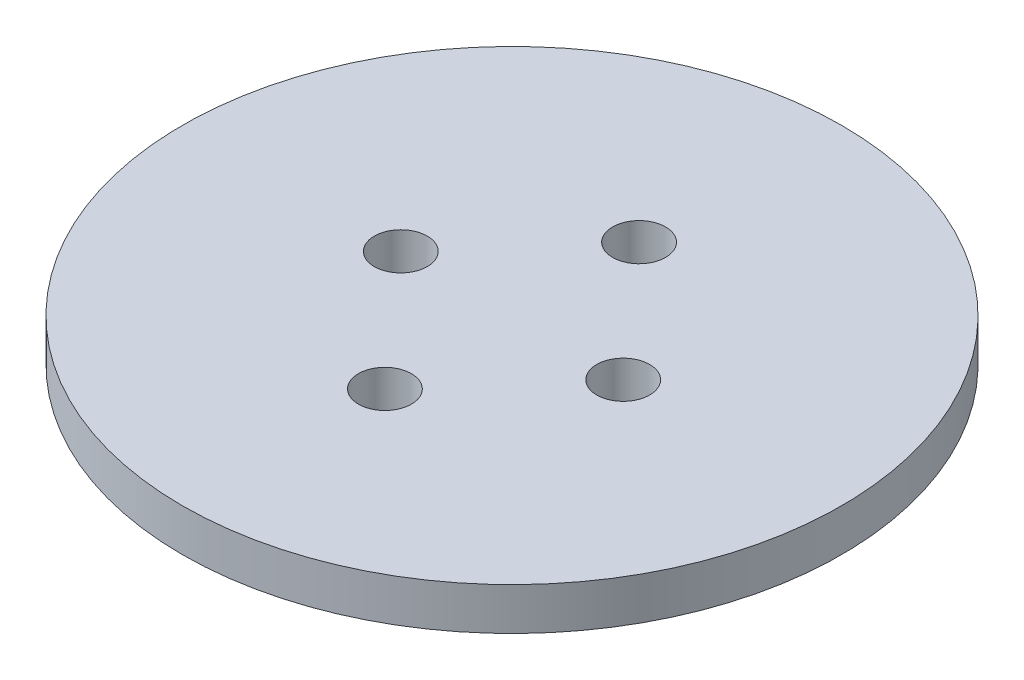
ISO-10303-21;
HEADER;
FILE_DESCRIPTION(('STEP AP214'),'2;1');
FILE_NAME('part.step','',(''),(''),'','','');
FILE_SCHEMA(('AUTOMOTIVE_DESIGN { 1 0 10303 214 1 1 1 1 }'));
ENDSEC;
DATA;
#1=APPLICATION_CONTEXT('core data for automotive mechanical design processes');
#2=APPLICATION_PROTOCOL_DEFINITION('international standard','automotive_design',2000,#1);
#3=PRODUCT_CONTEXT('',#1,'mechanical');
#4=PRODUCT('Part','Part','',(#3));
#5=PRODUCT_RELATED_PRODUCT_CATEGORY('part','',(#4));
#6=PRODUCT_DEFINITION_FORMATION('','',#4);
#7=PRODUCT_DEFINITION_CONTEXT('part definition',#1,'design');
#8=PRODUCT_DEFINITION('design','',#6,#7);
#9=PRODUCT_DEFINITION_SHAPE('','',#8);
#10=(LENGTH_UNIT() NAMED_UNIT(*) SI_UNIT(.MILLI.,.METRE.));
#11=(NAMED_UNIT(*) PLANE_ANGLE_UNIT() SI_UNIT($,.RADIAN.));
#12=(NAMED_UNIT(*) SI_UNIT($,.STERADIAN.) SOLID_ANGLE_UNIT());
#13=UNCERTAINTY_MEASURE_WITH_UNIT(LENGTH_MEASURE(1.E-05),#10,'distance_accuracy_value','');
#14=(GEOMETRIC_REPRESENTATION_CONTEXT(3) GLOBAL_UNCERTAINTY_ASSIGNED_CONTEXT((#13)) GLOBAL_UNIT_ASSIGNED_CONTEXT((#10,
#11,#12)) REPRESENTATION_CONTEXT('',''));
#15=CARTESIAN_POINT('',(0.,0.,0.));
#16=DIRECTION('',(0.,0.,1.));
#17=DIRECTION('',(1.,0.,0.));
#18=AXIS2_PLACEMENT_3D('',#15,#16,#17);
#19=CARTESIAN_POINT('',(0.,6.35,0.));
#20=DIRECTION('',(0.,-1.,0.));
#21=DIRECTION('',(0.,0.,-1.));
#22=AXIS2_PLACEMENT_3D('',#19,#20,#21);
#23=CYLINDRICAL_SURFACE('',#22,49.403);
#24=CARTESIAN_POINT('',(0.,6.35,0.));
#25=DIRECTION('',(0.,1.,0.));
#26=DIRECTION('',(0.,0.,1.));
#27=AXIS2_PLACEMENT_3D('',#24,#25,#26);
#28=CIRCLE('',#27,49.403);
#29=CARTESIAN_POINT('',(0.,6.35,49.403));
#30=VERTEX_POINT('',#29);
#31=EDGE_CURVE('E10',#30,#30,#28,.T.);
#32=ORIENTED_EDGE('',*,*,#31,.F.);
#33=EDGE_LOOP('',(#32));
#34=FACE_BOUND('',#33,.T.);
#35=CARTESIAN_POINT('',(0.,0.,0.));
#36=DIRECTION('',(0.,1.,0.));
#37=DIRECTION('',(0.,0.,1.));
#38=AXIS2_PLACEMENT_3D('',#35,#36,#37);
#39=CIRCLE('',#38,49.403);
#40=CARTESIAN_POINT('',(0.,0.,49.403));
#41=VERTEX_POINT('',#40);
#42=EDGE_CURVE('E42',#41,#41,#39,.T.);
#43=ORIENTED_EDGE('',*,*,#42,.T.);
#44=EDGE_LOOP('',(#43));
#45=FACE_BOUND('',#44,.T.);
#46=ADVANCED_FACE('F39',(#34,#45),#23,.T.);
#47=CARTESIAN_POINT('',(0.,6.35,0.));
#48=DIRECTION('',(0.,1.,0.));
#49=DIRECTION('',(0.,0.,1.));
#50=AXIS2_PLACEMENT_3D('',#47,#48,#49);
#51=PLANE('',#50);
#52=CARTESIAN_POINT('',(-16.66875,6.35,0.));
#53=DIRECTION('',(0.,1.,0.));
#54=DIRECTION('',(0.,0.,1.));
#55=AXIS2_PLACEMENT_3D('',#52,#53,#54);
#56=CIRCLE('',#55,3.96875);
#57=CARTESIAN_POINT('',(-16.66875,6.35,3.96875));
#58=VERTEX_POINT('',#57);
#59=EDGE_CURVE('E71',#58,#58,#56,.T.);
#60=ORIENTED_EDGE('',*,*,#59,.F.);
#61=EDGE_LOOP('',(#60));
#62=FACE_BOUND('',#61,.T.);
#63=CARTESIAN_POINT('',(16.66875,6.35,0.));
#64=DIRECTION('',(0.,1.,0.));
#65=DIRECTION('',(0.,0.,1.));
#66=AXIS2_PLACEMENT_3D('',#63,#64,#65);
#67=CIRCLE('',#66,3.96875);
#68=CARTESIAN_POINT('',(16.66875,6.35,3.96875));
#69=VERTEX_POINT('',#68);
#70=EDGE_CURVE('E65',#69,#69,#67,.T.);
#71=ORIENTED_EDGE('',*,*,#70,.F.);
#72=EDGE_LOOP('',(#71));
#73=FACE_BOUND('',#72,.T.);
#74=CARTESIAN_POINT('',(0.,6.35,-19.05));
#75=DIRECTION('',(0.,1.,0.));
#76=DIRECTION('',(0.,0.,1.));
#77=AXIS2_PLACEMENT_3D('',#74,#75,#76);
#78=CIRCLE('',#77,3.96875);
#79=CARTESIAN_POINT('',(0.,6.35,-15.08125));
#80=VERTEX_POINT('',#79);
#81=EDGE_CURVE('E59',#80,#80,#78,.T.);
#82=ORIENTED_EDGE('',*,*,#81,.F.);
#83=EDGE_LOOP('',(#82));
#84=FACE_BOUND('',#83,.T.);
#85=CARTESIAN_POINT('',(0.,6.35,19.05));
#86=DIRECTION('',(0.,1.,0.));
#87=DIRECTION('',(0.,0.,1.));
#88=AXIS2_PLACEMENT_3D('',#85,#86,#87);
#89=CIRCLE('',#88,3.96875);
#90=CARTESIAN_POINT('',(0.,6.35,23.01875));
#91=VERTEX_POINT('',#90);
#92=EDGE_CURVE('E53',#91,#91,#89,.T.);
#93=ORIENTED_EDGE('',*,*,#92,.F.);
#94=EDGE_LOOP('',(#93));
#95=FACE_BOUND('',#94,.T.);
#96=ORIENTED_EDGE('',*,*,#31,.T.);
#97=EDGE_LOOP('',(#96));
#98=FACE_BOUND('',#97,.T.);
#99=ADVANCED_FACE('F77',(#62,#73,#84,#95,#98),#51,.T.);
#100=CARTESIAN_POINT('',(0.,0.,0.));
#101=DIRECTION('',(0.,1.,0.));
#102=DIRECTION('',(0.,0.,1.));
#103=AXIS2_PLACEMENT_3D('',#100,#101,#102);
#104=PLANE('',#103);
#105=CARTESIAN_POINT('',(-16.66875,0.,0.));
#106=DIRECTION('',(0.,1.,0.));
#107=DIRECTION('',(0.,0.,1.));
#108=AXIS2_PLACEMENT_3D('',#105,#106,#107);
#109=CIRCLE('',#108,3.96875);
#110=CARTESIAN_POINT('',(-16.66875,0.,3.96875));
#111=VERTEX_POINT('',#110);
#112=EDGE_CURVE('E68',#111,#111,#109,.T.);
#113=ORIENTED_EDGE('',*,*,#112,.T.);
#114=EDGE_LOOP('',(#113));
#115=FACE_BOUND('',#114,.T.);
#116=CARTESIAN_POINT('',(16.66875,0.,0.));
#117=DIRECTION('',(0.,1.,0.));
#118=DIRECTION('',(0.,0.,1.));
#119=AXIS2_PLACEMENT_3D('',#116,#117,#118);
#120=CIRCLE('',#119,3.96875);
#121=CARTESIAN_POINT('',(16.66875,0.,3.96875));
#122=VERTEX_POINT('',#121);
#123=EDGE_CURVE('E62',#122,#122,#120,.T.);
#124=ORIENTED_EDGE('',*,*,#123,.T.);
#125=EDGE_LOOP('',(#124));
#126=FACE_BOUND('',#125,.T.);
#127=CARTESIAN_POINT('',(0.,0.,-19.05));
#128=DIRECTION('',(0.,1.,0.));
#129=DIRECTION('',(0.,0.,1.));
#130=AXIS2_PLACEMENT_3D('',#127,#128,#129);
#131=CIRCLE('',#130,3.96875);
#132=CARTESIAN_POINT('',(0.,0.,-15.08125));
#133=VERTEX_POINT('',#132);
#134=EDGE_CURVE('E56',#133,#133,#131,.T.);
#135=ORIENTED_EDGE('',*,*,#134,.T.);
#136=EDGE_LOOP('',(#135));
#137=FACE_BOUND('',#136,.T.);
#138=CARTESIAN_POINT('',(0.,0.,19.05));
#139=DIRECTION('',(0.,1.,0.));
#140=DIRECTION('',(0.,0.,1.));
#141=AXIS2_PLACEMENT_3D('',#138,#139,#140);
#142=CIRCLE('',#141,3.96875);
#143=CARTESIAN_POINT('',(0.,0.,23.01875));
#144=VERTEX_POINT('',#143);
#145=EDGE_CURVE('E49',#144,#144,#142,.T.);
#146=ORIENTED_EDGE('',*,*,#145,.T.);
#147=EDGE_LOOP('',(#146));
#148=FACE_BOUND('',#147,.T.);
#149=ORIENTED_EDGE('',*,*,#42,.F.);
#150=EDGE_LOOP('',(#149));
#151=FACE_BOUND('',#150,.T.);
#152=ADVANCED_FACE('F80',(#115,#126,#137,#148,#151),#104,.F.);
#153=CARTESIAN_POINT('',(0.,6.35,19.05));
#154=DIRECTION('',(0.,1.,0.));
#155=DIRECTION('',(0.,0.,1.));
#156=AXIS2_PLACEMENT_3D('',#153,#154,#155);
#157=CYLINDRICAL_SURFACE('',#156,3.96875);
#158=ORIENTED_EDGE('',*,*,#145,.F.);
#159=EDGE_LOOP('',(#158));
#160=FACE_BOUND('',#159,.T.);
#161=ORIENTED_EDGE('',*,*,#92,.T.);
#162=EDGE_LOOP('',(#161));
#163=FACE_BOUND('',#162,.T.);
#164=ADVANCED_FACE('F88',(#160,#163),#157,.F.);
#165=CARTESIAN_POINT('',(0.,6.35,-19.05));
#166=DIRECTION('',(0.,1.,0.));
#167=DIRECTION('',(0.,0.,1.));
#168=AXIS2_PLACEMENT_3D('',#165,#166,#167);
#169=CYLINDRICAL_SURFACE('',#168,3.96875);
#170=ORIENTED_EDGE('',*,*,#134,.F.);
#171=EDGE_LOOP('',(#170));
#172=FACE_BOUND('',#171,.T.);
#173=ORIENTED_EDGE('',*,*,#81,.T.);
#174=EDGE_LOOP('',(#173));
#175=FACE_BOUND('',#174,.T.);
#176=ADVANCED_FACE('F90',(#172,#175),#169,.F.);
#177=CARTESIAN_POINT('',(16.66875,6.35,0.));
#178=DIRECTION('',(0.,1.,0.));
#179=DIRECTION('',(0.,0.,1.));
#180=AXIS2_PLACEMENT_3D('',#177,#178,#179);
#181=CYLINDRICAL_SURFACE('',#180,3.96875);
#182=ORIENTED_EDGE('',*,*,#123,.F.);
#183=EDGE_LOOP('',(#182));
#184=FACE_BOUND('',#183,.T.);
#185=ORIENTED_EDGE('',*,*,#70,.T.);
#186=EDGE_LOOP('',(#185));
#187=FACE_BOUND('',#186,.T.);
#188=ADVANCED_FACE('F97',(#184,#187),#181,.F.);
#189=CARTESIAN_POINT('',(-16.66875,6.35,0.));
#190=DIRECTION('',(0.,1.,0.));
#191=DIRECTION('',(0.,0.,1.));
#192=AXIS2_PLACEMENT_3D('',#189,#190,#191);
#193=CYLINDRICAL_SURFACE('',#192,3.96875);
#194=ORIENTED_EDGE('',*,*,#112,.F.);
#195=EDGE_LOOP('',(#194));
#196=FACE_BOUND('',#195,.T.);
#197=ORIENTED_EDGE('',*,*,#59,.T.);
#198=EDGE_LOOP('',(#197));
#199=FACE_BOUND('',#198,.T.);
#200=ADVANCED_FACE('F75',(#196,#199),#193,.F.);
#201=CLOSED_SHELL('',(#46,#99,#152,#164,#176,#188,#200));
#202=MANIFOLD_SOLID_BREP('B2',#201);
#203=ADVANCED_BREP_SHAPE_REPRESENTATION('',(#18,#202),#14);
#204=SHAPE_DEFINITION_REPRESENTATION(#9,#203);
ENDSEC;
END-ISO-10303-21;
